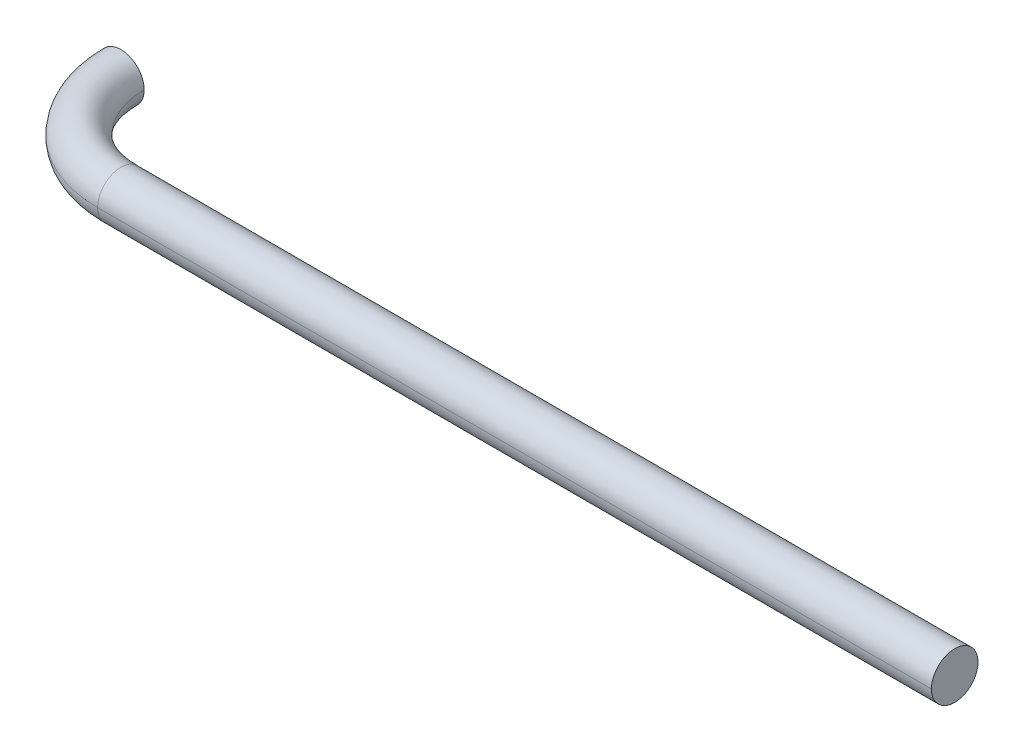
ISO-10303-21;
HEADER;
FILE_DESCRIPTION(('STEP AP214'),'2;1');
FILE_NAME('part.step','',(''),(''),'','','');
FILE_SCHEMA(('AUTOMOTIVE_DESIGN { 1 0 10303 214 1 1 1 1 }'));
ENDSEC;
DATA;
#1=APPLICATION_CONTEXT('core data for automotive mechanical design processes');
#2=APPLICATION_PROTOCOL_DEFINITION('international standard','automotive_design',2000,#1);
#3=PRODUCT_CONTEXT('',#1,'mechanical');
#4=PRODUCT('Part','Part','',(#3));
#5=PRODUCT_RELATED_PRODUCT_CATEGORY('part','',(#4));
#6=PRODUCT_DEFINITION_FORMATION('','',#4);
#7=PRODUCT_DEFINITION_CONTEXT('part definition',#1,'design');
#8=PRODUCT_DEFINITION('design','',#6,#7);
#9=PRODUCT_DEFINITION_SHAPE('','',#8);
#10=(LENGTH_UNIT() NAMED_UNIT(*) SI_UNIT(.MILLI.,.METRE.));
#11=(NAMED_UNIT(*) PLANE_ANGLE_UNIT() SI_UNIT($,.RADIAN.));
#12=(NAMED_UNIT(*) SI_UNIT($,.STERADIAN.) SOLID_ANGLE_UNIT());
#13=UNCERTAINTY_MEASURE_WITH_UNIT(LENGTH_MEASURE(1.E-05),#10,'distance_accuracy_value','');
#14=(GEOMETRIC_REPRESENTATION_CONTEXT(3) GLOBAL_UNCERTAINTY_ASSIGNED_CONTEXT((#13)) GLOBAL_UNIT_ASSIGNED_CONTEXT((#10,
#11,#12)) REPRESENTATION_CONTEXT('',''));
#15=CARTESIAN_POINT('',(0.,0.,0.));
#16=DIRECTION('',(0.,0.,1.));
#17=DIRECTION('',(1.,0.,0.));
#18=AXIS2_PLACEMENT_3D('',#15,#16,#17);
#19=CARTESIAN_POINT('',(3.4999999999986,0.,1.39727442019107E-12));
#20=DIRECTION('',(0.,1.,0.));
#21=DIRECTION('',(-1.,0.,-3.99221262911893E-13));
#22=AXIS2_PLACEMENT_3D('',#19,#20,#21);
#23=TOROIDAL_SURFACE('',#22,3.4999999999986,0.8);
#24=CARTESIAN_POINT('',(3.4999999999986,0.,1.39727442019107E-12));
#25=DIRECTION('',(0.,1.,0.));
#26=DIRECTION('',(0.,0.,1.));
#27=AXIS2_PLACEMENT_3D('',#24,#25,#26);
#28=CIRCLE('',#27,4.2999999999986);
#29=CARTESIAN_POINT('',(-0.8,0.,0.));
#30=VERTEX_POINT('',#29);
#31=CARTESIAN_POINT('',(3.49999999999744,0.,4.3));
#32=VERTEX_POINT('',#31);
#33=EDGE_CURVE('E69',#30,#32,#28,.T.);
#34=ORIENTED_EDGE('',*,*,#33,.F.);
#35=CARTESIAN_POINT('',(0.,0.,0.));
#36=DIRECTION('',(0.,0.,1.));
#37=DIRECTION('',(-1.,0.,0.));
#38=AXIS2_PLACEMENT_3D('',#35,#36,#37);
#39=CIRCLE('',#38,0.8);
#40=CARTESIAN_POINT('',(0.8,0.,0.));
#41=VERTEX_POINT('',#40);
#42=EDGE_CURVE('E21',#30,#41,#39,.T.);
#43=ORIENTED_EDGE('',*,*,#42,.T.);
#44=CARTESIAN_POINT('',(3.4999999999986,0.,1.39727442019107E-12));
#45=DIRECTION('',(0.,1.,0.));
#46=DIRECTION('',(0.,0.,1.));
#47=AXIS2_PLACEMENT_3D('',#44,#45,#46);
#48=CIRCLE('',#47,2.6999999999986);
#49=CARTESIAN_POINT('',(3.49999999999787,0.,2.7));
#50=VERTEX_POINT('',#49);
#51=EDGE_CURVE('E79',#41,#50,#48,.T.);
#52=ORIENTED_EDGE('',*,*,#51,.T.);
#53=CARTESIAN_POINT('',(3.49999999999765,0.,3.5));
#54=DIRECTION('',(1.,0.,2.71592644207619E-13));
#55=DIRECTION('',(-2.71592644207619E-13,0.,1.));
#56=AXIS2_PLACEMENT_3D('',#53,#54,#55);
#57=CIRCLE('',#56,0.8);
#58=EDGE_CURVE('E71',#32,#50,#57,.T.);
#59=ORIENTED_EDGE('',*,*,#58,.F.);
#60=EDGE_LOOP('',(#34,#43,#52,#59));
#61=FACE_BOUND('',#60,.T.);
#62=ADVANCED_FACE('F17',(#61),#23,.T.);
#63=CARTESIAN_POINT('',(3.49999999999765,0.,3.5));
#64=DIRECTION('',(1.,0.,0.));
#65=DIRECTION('',(0.,0.,1.));
#66=AXIS2_PLACEMENT_3D('',#63,#64,#65);
#67=CYLINDRICAL_SURFACE('',#66,0.8);
#68=DIRECTION('',(1.,0.,0.));
#69=VECTOR('',#68,1.);
#70=CARTESIAN_POINT('',(3.49999999999765,0.,2.7));
#71=LINE('',#70,#69);
#72=CARTESIAN_POINT('',(32.1389851691479,0.,2.7));
#73=VERTEX_POINT('',#72);
#74=EDGE_CURVE('E89',#50,#73,#71,.T.);
#75=ORIENTED_EDGE('',*,*,#74,.F.);
#76=CARTESIAN_POINT('',(3.49999999999765,0.,3.5));
#77=DIRECTION('',(1.,0.,2.71592644207619E-13));
#78=DIRECTION('',(-2.71592644207619E-13,0.,1.));
#79=AXIS2_PLACEMENT_3D('',#76,#77,#78);
#80=CIRCLE('',#79,0.8);
#81=EDGE_CURVE('E76',#50,#32,#80,.T.);
#82=ORIENTED_EDGE('',*,*,#81,.T.);
#83=DIRECTION('',(1.,0.,0.));
#84=VECTOR('',#83,1.);
#85=CARTESIAN_POINT('',(3.49999999999765,0.,4.3));
#86=LINE('',#85,#84);
#87=CARTESIAN_POINT('',(32.1389851691481,0.,4.3));
#88=VERTEX_POINT('',#87);
#89=EDGE_CURVE('E66',#32,#88,#86,.T.);
#90=ORIENTED_EDGE('',*,*,#89,.T.);
#91=CARTESIAN_POINT('',(32.138985169148,0.,3.5));
#92=DIRECTION('',(1.,0.,-1.3010426069826E-13));
#93=DIRECTION('',(1.3010426069826E-13,0.,1.));
#94=AXIS2_PLACEMENT_3D('',#91,#92,#93);
#95=CIRCLE('',#94,0.8);
#96=EDGE_CURVE('E11',#73,#88,#95,.T.);
#97=ORIENTED_EDGE('',*,*,#96,.F.);
#98=EDGE_LOOP('',(#75,#82,#90,#97));
#99=FACE_BOUND('',#98,.T.);
#100=ADVANCED_FACE('F19',(#99),#67,.T.);
#101=CARTESIAN_POINT('',(32.138985169148,0.,3.5));
#102=DIRECTION('',(1.,0.,-1.27491950812021E-13));
#103=DIRECTION('',(-1.27491950812021E-13,0.,-1.));
#104=AXIS2_PLACEMENT_3D('',#101,#102,#103);
#105=PLANE('',#104);
#106=CARTESIAN_POINT('',(32.138985169148,0.,3.5));
#107=DIRECTION('',(1.,0.,-1.3010426069826E-13));
#108=DIRECTION('',(1.3010426069826E-13,0.,1.));
#109=AXIS2_PLACEMENT_3D('',#106,#107,#108);
#110=CIRCLE('',#109,0.8);
#111=EDGE_CURVE('E93',#88,#73,#110,.T.);
#112=ORIENTED_EDGE('',*,*,#111,.T.);
#113=ORIENTED_EDGE('',*,*,#96,.T.);
#114=EDGE_LOOP('',(#112,#113));
#115=FACE_BOUND('',#114,.T.);
#116=ADVANCED_FACE('F103',(#115),#105,.T.);
#117=CARTESIAN_POINT('',(0.,0.,0.));
#118=DIRECTION('',(0.,0.,1.));
#119=DIRECTION('',(1.,0.,0.));
#120=AXIS2_PLACEMENT_3D('',#117,#118,#119);
#121=PLANE('',#120);
#122=CARTESIAN_POINT('',(0.,0.,0.));
#123=DIRECTION('',(0.,0.,1.));
#124=DIRECTION('',(-1.,0.,0.));
#125=AXIS2_PLACEMENT_3D('',#122,#123,#124);
#126=CIRCLE('',#125,0.8);
#127=EDGE_CURVE('E61',#41,#30,#126,.T.);
#128=ORIENTED_EDGE('',*,*,#127,.F.);
#129=ORIENTED_EDGE('',*,*,#42,.F.);
#130=EDGE_LOOP('',(#128,#129));
#131=FACE_BOUND('',#130,.T.);
#132=ADVANCED_FACE('F59',(#131),#121,.F.);
#133=CARTESIAN_POINT('',(3.49999999999765,0.,3.5));
#134=DIRECTION('',(1.,0.,0.));
#135=DIRECTION('',(0.,0.,1.));
#136=AXIS2_PLACEMENT_3D('',#133,#134,#135);
#137=CYLINDRICAL_SURFACE('',#136,0.8);
#138=ORIENTED_EDGE('',*,*,#58,.T.);
#139=ORIENTED_EDGE('',*,*,#74,.T.);
#140=ORIENTED_EDGE('',*,*,#111,.F.);
#141=ORIENTED_EDGE('',*,*,#89,.F.);
#142=EDGE_LOOP('',(#138,#139,#140,#141));
#143=FACE_BOUND('',#142,.T.);
#144=ADVANCED_FACE('F102',(#143),#137,.T.);
#145=CARTESIAN_POINT('',(3.4999999999986,0.,1.39727442019107E-12));
#146=DIRECTION('',(0.,1.,0.));
#147=DIRECTION('',(-1.,0.,-3.99221262911893E-13));
#148=AXIS2_PLACEMENT_3D('',#145,#146,#147);
#149=TOROIDAL_SURFACE('',#148,3.4999999999986,0.8);
#150=ORIENTED_EDGE('',*,*,#127,.T.);
#151=ORIENTED_EDGE('',*,*,#33,.T.);
#152=ORIENTED_EDGE('',*,*,#81,.F.);
#153=ORIENTED_EDGE('',*,*,#51,.F.);
#154=EDGE_LOOP('',(#150,#151,#152,#153));
#155=FACE_BOUND('',#154,.T.);
#156=ADVANCED_FACE('F78',(#155),#149,.T.);
#157=CLOSED_SHELL('',(#62,#100,#116,#132,#144,#156));
#158=MANIFOLD_SOLID_BREP('B1',#157);
#159=ADVANCED_BREP_SHAPE_REPRESENTATION('',(#18,#158),#14);
#160=SHAPE_DEFINITION_REPRESENTATION(#9,#159);
ENDSEC;
END-ISO-10303-21;
